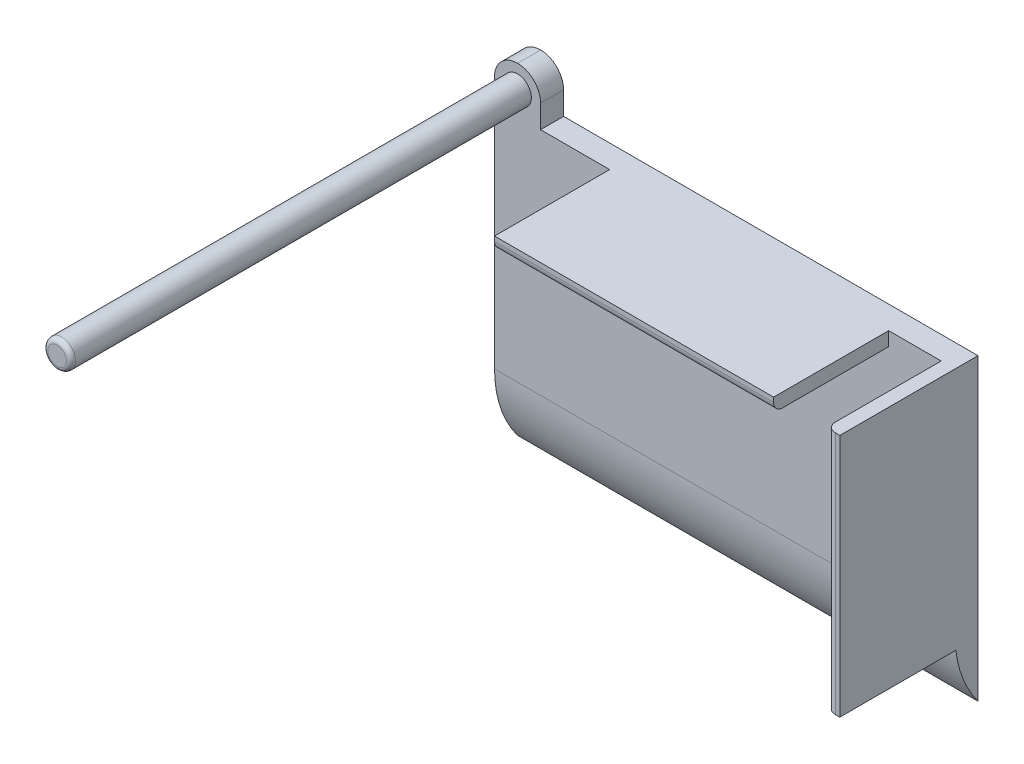
ISO-10303-21;
HEADER;
FILE_DESCRIPTION(('STEP AP214'),'2;1');
FILE_NAME('part.step','',(''),(''),'','','');
FILE_SCHEMA(('AUTOMOTIVE_DESIGN { 1 0 10303 214 1 1 1 1 }'));
ENDSEC;
DATA;
#1=APPLICATION_CONTEXT('core data for automotive mechanical design processes');
#2=APPLICATION_PROTOCOL_DEFINITION('international standard','automotive_design',2000,#1);
#3=PRODUCT_CONTEXT('',#1,'mechanical');
#4=PRODUCT('Part','Part','',(#3));
#5=PRODUCT_RELATED_PRODUCT_CATEGORY('part','',(#4));
#6=PRODUCT_DEFINITION_FORMATION('','',#4);
#7=PRODUCT_DEFINITION_CONTEXT('part definition',#1,'design');
#8=PRODUCT_DEFINITION('design','',#6,#7);
#9=PRODUCT_DEFINITION_SHAPE('','',#8);
#10=(LENGTH_UNIT() NAMED_UNIT(*) SI_UNIT(.MILLI.,.METRE.));
#11=(NAMED_UNIT(*) PLANE_ANGLE_UNIT() SI_UNIT($,.RADIAN.));
#12=(NAMED_UNIT(*) SI_UNIT($,.STERADIAN.) SOLID_ANGLE_UNIT());
#13=UNCERTAINTY_MEASURE_WITH_UNIT(LENGTH_MEASURE(1.E-05),#10,'distance_accuracy_value','');
#14=(GEOMETRIC_REPRESENTATION_CONTEXT(3) GLOBAL_UNCERTAINTY_ASSIGNED_CONTEXT((#13)) GLOBAL_UNIT_ASSIGNED_CONTEXT((#10,
#11,#12)) REPRESENTATION_CONTEXT('',''));
#15=CARTESIAN_POINT('',(0.,0.,0.));
#16=DIRECTION('',(0.,0.,1.));
#17=DIRECTION('',(1.,0.,0.));
#18=AXIS2_PLACEMENT_3D('',#15,#16,#17);
#19=CARTESIAN_POINT('',(0.,0.,30.));
#20=DIRECTION('',(0.,0.,-1.));
#21=DIRECTION('',(-1.,0.,0.));
#22=AXIS2_PLACEMENT_3D('',#19,#20,#21);
#23=PLANE('',#22);
#24=DIRECTION('',(1.,0.,0.));
#25=VECTOR('',#24,1.);
#26=CARTESIAN_POINT('',(-25.,32.5,30.));
#27=LINE('',#26,#25);
#28=CARTESIAN_POINT('',(49.,32.5,30.));
#29=VERTEX_POINT('',#28);
#30=CARTESIAN_POINT('',(50.,32.5,30.));
#31=VERTEX_POINT('',#30);
#32=EDGE_CURVE('E186',#29,#31,#27,.T.);
#33=ORIENTED_EDGE('',*,*,#32,.F.);
#34=DIRECTION('',(0.,1.,0.));
#35=VECTOR('',#34,1.);
#36=CARTESIAN_POINT('',(49.,-20.5,30.));
#37=LINE('',#36,#35);
#38=CARTESIAN_POINT('',(49.,-20.5,30.));
#39=VERTEX_POINT('',#38);
#40=EDGE_CURVE('E270',#29,#39,#37,.F.);
#41=ORIENTED_EDGE('',*,*,#40,.T.);
#42=DIRECTION('',(-1.,0.,0.));
#43=VECTOR('',#42,1.);
#44=CARTESIAN_POINT('',(50.,-20.5,30.));
#45=LINE('',#44,#43);
#46=CARTESIAN_POINT('',(50.,-20.5,30.));
#47=VERTEX_POINT('',#46);
#48=EDGE_CURVE('E327',#47,#39,#45,.T.);
#49=ORIENTED_EDGE('',*,*,#48,.F.);
#50=DIRECTION('',(0.,-1.,0.));
#51=VECTOR('',#50,1.);
#52=CARTESIAN_POINT('',(50.,32.5,30.));
#53=LINE('',#52,#51);
#54=EDGE_CURVE('E324',#31,#47,#53,.T.);
#55=ORIENTED_EDGE('',*,*,#54,.F.);
#56=EDGE_LOOP('',(#33,#41,#49,#55));
#57=FACE_BOUND('',#56,.T.);
#58=ADVANCED_FACE('F47',(#57),#23,.F.);
#59=CARTESIAN_POINT('',(-50.,32.5,5.));
#60=DIRECTION('',(0.,-1.,0.));
#61=DIRECTION('',(0.,0.,-1.));
#62=AXIS2_PLACEMENT_3D('',#59,#60,#61);
#63=PLANE('',#62);
#64=DIRECTION('',(0.,0.,1.));
#65=VECTOR('',#64,1.);
#66=CARTESIAN_POINT('',(47.,32.5,5.));
#67=LINE('',#66,#65);
#68=CARTESIAN_POINT('',(47.,32.5,5.));
#69=VERTEX_POINT('',#68);
#70=CARTESIAN_POINT('',(47.,32.5,28.));
#71=VERTEX_POINT('',#70);
#72=EDGE_CURVE('E316',#69,#71,#67,.T.);
#73=ORIENTED_EDGE('',*,*,#72,.T.);
#74=CARTESIAN_POINT('',(49.,32.5,28.));
#75=DIRECTION('',(0.,-1.,0.));
#76=DIRECTION('',(0.,0.,-1.));
#77=AXIS2_PLACEMENT_3D('',#74,#75,#76);
#78=CIRCLE('',#77,2.);
#79=EDGE_CURVE('E268',#71,#29,#78,.F.);
#80=ORIENTED_EDGE('',*,*,#79,.T.);
#81=ORIENTED_EDGE('',*,*,#32,.T.);
#82=DIRECTION('',(0.,0.,-1.));
#83=VECTOR('',#82,1.);
#84=CARTESIAN_POINT('',(50.,32.5,5.));
#85=LINE('',#84,#83);
#86=CARTESIAN_POINT('',(50.,32.5,0.));
#87=VERTEX_POINT('',#86);
#88=EDGE_CURVE('E214',#31,#87,#85,.T.);
#89=ORIENTED_EDGE('',*,*,#88,.T.);
#90=DIRECTION('',(-1.,0.,0.));
#91=VECTOR('',#90,1.);
#92=CARTESIAN_POINT('',(-50.,32.5,0.));
#93=LINE('',#92,#91);
#94=CARTESIAN_POINT('',(-40.,32.5,0.));
#95=VERTEX_POINT('',#94);
#96=EDGE_CURVE('E217',#87,#95,#93,.T.);
#97=ORIENTED_EDGE('',*,*,#96,.T.);
#98=DIRECTION('',(0.,0.,-1.));
#99=VECTOR('',#98,1.);
#100=CARTESIAN_POINT('',(-40.,32.5,5.));
#101=LINE('',#100,#99);
#102=CARTESIAN_POINT('',(-40.,32.5,5.));
#103=VERTEX_POINT('',#102);
#104=EDGE_CURVE('E194',#103,#95,#101,.T.);
#105=ORIENTED_EDGE('',*,*,#104,.F.);
#106=DIRECTION('',(-1.,0.,0.));
#107=VECTOR('',#106,1.);
#108=CARTESIAN_POINT('',(-50.,32.5,5.));
#109=LINE('',#108,#107);
#110=CARTESIAN_POINT('',(-25.,32.5,5.));
#111=VERTEX_POINT('',#110);
#112=EDGE_CURVE('E208',#111,#103,#109,.T.);
#113=ORIENTED_EDGE('',*,*,#112,.F.);
#114=DIRECTION('',(0.,0.,-1.));
#115=VECTOR('',#114,1.);
#116=CARTESIAN_POINT('',(-25.,32.5,30.));
#117=LINE('',#116,#115);
#118=CARTESIAN_POINT('',(-25.,32.5,30.));
#119=VERTEX_POINT('',#118);
#120=EDGE_CURVE('E192',#119,#111,#117,.T.);
#121=ORIENTED_EDGE('',*,*,#120,.F.);
#122=CARTESIAN_POINT('',(35.603755634213,32.5,30.));
#123=VERTEX_POINT('',#122);
#124=EDGE_CURVE('E322',#119,#123,#27,.T.);
#125=ORIENTED_EDGE('',*,*,#124,.T.);
#126=DIRECTION('',(0.,0.,-1.));
#127=VECTOR('',#126,1.);
#128=CARTESIAN_POINT('',(35.603755634213,32.5,5.));
#129=LINE('',#128,#127);
#130=CARTESIAN_POINT('',(35.603755634213,32.5,5.));
#131=VERTEX_POINT('',#130);
#132=EDGE_CURVE('E179',#123,#131,#129,.T.);
#133=ORIENTED_EDGE('',*,*,#132,.T.);
#134=DIRECTION('',(-1.,0.,0.));
#135=VECTOR('',#134,1.);
#136=CARTESIAN_POINT('',(-50.,32.5,5.));
#137=LINE('',#136,#135);
#138=EDGE_CURVE('E167',#69,#131,#137,.T.);
#139=ORIENTED_EDGE('',*,*,#138,.F.);
#140=EDGE_LOOP('',(#73,#80,#81,#89,#97,#105,#113,#121,#125,#133,#139));
#141=FACE_BOUND('',#140,.T.);
#142=ADVANCED_FACE('F284',(#141),#63,.F.);
#143=CARTESIAN_POINT('',(50.,-32.5,5.));
#144=DIRECTION('',(-1.,0.,0.));
#145=DIRECTION('',(0.,0.,1.));
#146=AXIS2_PLACEMENT_3D('',#143,#144,#145);
#147=PLANE('',#146);
#148=DIRECTION('',(0.,0.,-1.));
#149=VECTOR('',#148,1.);
#150=CARTESIAN_POINT('',(50.,-20.5,30.));
#151=LINE('',#150,#149);
#152=CARTESIAN_POINT('',(50.,-20.5,4.81934729198171));
#153=VERTEX_POINT('',#152);
#154=EDGE_CURVE('E198',#47,#153,#151,.T.);
#155=ORIENTED_EDGE('',*,*,#154,.T.);
#156=CARTESIAN_POINT('',(50.,-17.5,-20.));
#157=DIRECTION('',(-1.,0.,0.));
#158=DIRECTION('',(0.,0.,1.));
#159=AXIS2_PLACEMENT_3D('',#156,#157,#158);
#160=CIRCLE('',#159,25.);
#161=CARTESIAN_POINT('',(50.,-32.5,0.));
#162=VERTEX_POINT('',#161);
#163=EDGE_CURVE('E247',#153,#162,#160,.F.);
#164=ORIENTED_EDGE('',*,*,#163,.T.);
#165=DIRECTION('',(0.,1.,0.));
#166=VECTOR('',#165,1.);
#167=CARTESIAN_POINT('',(50.,-32.5,0.));
#168=LINE('',#167,#166);
#169=EDGE_CURVE('E207',#162,#87,#168,.T.);
#170=ORIENTED_EDGE('',*,*,#169,.T.);
#171=ORIENTED_EDGE('',*,*,#88,.F.);
#172=ORIENTED_EDGE('',*,*,#54,.T.);
#173=EDGE_LOOP('',(#155,#164,#170,#171,#172));
#174=FACE_BOUND('',#173,.T.);
#175=ADVANCED_FACE('F342',(#174),#147,.F.);
#176=CARTESIAN_POINT('',(-50.,-32.5,5.));
#177=DIRECTION('',(1.,0.,0.));
#178=DIRECTION('',(0.,0.,-1.));
#179=AXIS2_PLACEMENT_3D('',#176,#177,#178);
#180=PLANE('',#179);
#181=DIRECTION('',(0.,-1.,0.));
#182=VECTOR('',#181,1.);
#183=CARTESIAN_POINT('',(-50.,-32.5,0.));
#184=LINE('',#183,#182);
#185=CARTESIAN_POINT('',(-50.,37.5,0.));
#186=VERTEX_POINT('',#185);
#187=CARTESIAN_POINT('',(-50.,-32.5,0.));
#188=VERTEX_POINT('',#187);
#189=EDGE_CURVE('E220',#186,#188,#184,.T.);
#190=ORIENTED_EDGE('',*,*,#189,.T.);
#191=CARTESIAN_POINT('',(-50.,-17.5,-20.));
#192=DIRECTION('',(1.,0.,0.));
#193=DIRECTION('',(0.,0.,-1.));
#194=AXIS2_PLACEMENT_3D('',#191,#192,#193);
#195=CIRCLE('',#194,25.);
#196=CARTESIAN_POINT('',(-50.,-17.5,5.));
#197=VERTEX_POINT('',#196);
#198=EDGE_CURVE('E249',#188,#197,#195,.F.);
#199=ORIENTED_EDGE('',*,*,#198,.T.);
#200=DIRECTION('',(0.,-1.,0.));
#201=VECTOR('',#200,1.);
#202=CARTESIAN_POINT('',(-50.,-32.5,5.));
#203=LINE('',#202,#201);
#204=CARTESIAN_POINT('',(-50.,37.5,5.));
#205=VERTEX_POINT('',#204);
#206=EDGE_CURVE('E211',#205,#197,#203,.T.);
#207=ORIENTED_EDGE('',*,*,#206,.F.);
#208=DIRECTION('',(0.,0.,1.));
#209=VECTOR('',#208,1.);
#210=CARTESIAN_POINT('',(-50.,37.5,5.));
#211=LINE('',#210,#209);
#212=EDGE_CURVE('E233',#205,#186,#211,.F.);
#213=ORIENTED_EDGE('',*,*,#212,.T.);
#214=EDGE_LOOP('',(#190,#199,#207,#213));
#215=FACE_BOUND('',#214,.T.);
#216=ADVANCED_FACE('F303',(#215),#180,.F.);
#217=CARTESIAN_POINT('',(0.,0.,5.));
#218=DIRECTION('',(0.,0.,-1.));
#219=DIRECTION('',(-1.,0.,0.));
#220=AXIS2_PLACEMENT_3D('',#217,#218,#219);
#221=PLANE('',#220);
#222=CARTESIAN_POINT('',(-45.,37.5,5.));
#223=DIRECTION('',(0.,0.,-1.));
#224=DIRECTION('',(-1.,0.,0.));
#225=AXIS2_PLACEMENT_3D('',#222,#223,#224);
#226=CIRCLE('',#225,3.);
#227=CARTESIAN_POINT('',(-48.,37.5,5.));
#228=VERTEX_POINT('',#227);
#229=EDGE_CURVE('E226',#228,#228,#226,.F.);
#230=ORIENTED_EDGE('',*,*,#229,.F.);
#231=EDGE_LOOP('',(#230));
#232=FACE_BOUND('',#231,.T.);
#233=ORIENTED_EDGE('',*,*,#206,.T.);
#234=DIRECTION('',(-1.,0.,0.));
#235=VECTOR('',#234,1.);
#236=CARTESIAN_POINT('',(0.,-17.5,5.));
#237=LINE('',#236,#235);
#238=CARTESIAN_POINT('',(47.,-17.5,5.));
#239=VERTEX_POINT('',#238);
#240=EDGE_CURVE('E242',#197,#239,#237,.F.);
#241=ORIENTED_EDGE('',*,*,#240,.T.);
#242=DIRECTION('',(0.,1.,0.));
#243=VECTOR('',#242,1.);
#244=CARTESIAN_POINT('',(47.,-20.5,5.));
#245=LINE('',#244,#243);
#246=EDGE_CURVE('E184',#239,#69,#245,.T.);
#247=ORIENTED_EDGE('',*,*,#246,.T.);
#248=ORIENTED_EDGE('',*,*,#138,.T.);
#249=DIRECTION('',(0.,-1.,0.));
#250=VECTOR('',#249,1.);
#251=CARTESIAN_POINT('',(35.603755634213,29.5,5.));
#252=LINE('',#251,#250);
#253=CARTESIAN_POINT('',(35.603755634213,29.5,5.));
#254=VERTEX_POINT('',#253);
#255=EDGE_CURVE('E158',#131,#254,#252,.T.);
#256=ORIENTED_EDGE('',*,*,#255,.T.);
#257=DIRECTION('',(-1.,0.,0.));
#258=VECTOR('',#257,1.);
#259=CARTESIAN_POINT('',(47.,29.5,5.));
#260=LINE('',#259,#258);
#261=CARTESIAN_POINT('',(-25.,29.5,5.));
#262=VERTEX_POINT('',#261);
#263=EDGE_CURVE('E164',#254,#262,#260,.T.);
#264=ORIENTED_EDGE('',*,*,#263,.T.);
#265=DIRECTION('',(0.,1.,0.));
#266=VECTOR('',#265,1.);
#267=CARTESIAN_POINT('',(-25.,29.5,5.));
#268=LINE('',#267,#266);
#269=EDGE_CURVE('E183',#262,#111,#268,.T.);
#270=ORIENTED_EDGE('',*,*,#269,.T.);
#271=ORIENTED_EDGE('',*,*,#112,.T.);
#272=DIRECTION('',(0.,-1.,0.));
#273=VECTOR('',#272,1.);
#274=CARTESIAN_POINT('',(-40.,42.5,5.));
#275=LINE('',#274,#273);
#276=CARTESIAN_POINT('',(-40.,37.5,5.));
#277=VERTEX_POINT('',#276);
#278=EDGE_CURVE('E205',#277,#103,#275,.T.);
#279=ORIENTED_EDGE('',*,*,#278,.F.);
#280=CARTESIAN_POINT('',(-45.,37.5,5.));
#281=DIRECTION('',(0.,0.,-1.));
#282=DIRECTION('',(-1.,0.,0.));
#283=AXIS2_PLACEMENT_3D('',#280,#281,#282);
#284=CIRCLE('',#283,5.);
#285=CARTESIAN_POINT('',(-45.,42.5,5.));
#286=VERTEX_POINT('',#285);
#287=EDGE_CURVE('E229',#277,#286,#284,.F.);
#288=ORIENTED_EDGE('',*,*,#287,.T.);
#289=CARTESIAN_POINT('',(-45.,37.5,5.));
#290=DIRECTION('',(0.,0.,-1.));
#291=DIRECTION('',(-1.,0.,0.));
#292=AXIS2_PLACEMENT_3D('',#289,#290,#291);
#293=CIRCLE('',#292,5.);
#294=EDGE_CURVE('E231',#286,#205,#293,.F.);
#295=ORIENTED_EDGE('',*,*,#294,.T.);
#296=EDGE_LOOP('',(#233,#241,#247,#248,#256,#264,#270,#271,#279,#288,#295));
#297=FACE_BOUND('',#296,.T.);
#298=ADVANCED_FACE('F161',(#232,#297),#221,.F.);
#299=CARTESIAN_POINT('',(0.,0.,0.));
#300=DIRECTION('',(0.,0.,-1.));
#301=DIRECTION('',(-1.,0.,0.));
#302=AXIS2_PLACEMENT_3D('',#299,#300,#301);
#303=PLANE('',#302);
#304=ORIENTED_EDGE('',*,*,#189,.F.);
#305=CARTESIAN_POINT('',(-45.,37.5,0.));
#306=DIRECTION('',(0.,0.,-1.));
#307=DIRECTION('',(-1.,0.,0.));
#308=AXIS2_PLACEMENT_3D('',#305,#306,#307);
#309=CIRCLE('',#308,5.);
#310=CARTESIAN_POINT('',(-45.,42.5,0.));
#311=VERTEX_POINT('',#310);
#312=EDGE_CURVE('E238',#186,#311,#309,.T.);
#313=ORIENTED_EDGE('',*,*,#312,.T.);
#314=CARTESIAN_POINT('',(-45.,37.5,0.));
#315=DIRECTION('',(0.,0.,-1.));
#316=DIRECTION('',(-1.,0.,0.));
#317=AXIS2_PLACEMENT_3D('',#314,#315,#316);
#318=CIRCLE('',#317,5.);
#319=CARTESIAN_POINT('',(-40.,37.5,0.));
#320=VERTEX_POINT('',#319);
#321=EDGE_CURVE('E236',#311,#320,#318,.T.);
#322=ORIENTED_EDGE('',*,*,#321,.T.);
#323=DIRECTION('',(0.,-1.,0.));
#324=VECTOR('',#323,1.);
#325=CARTESIAN_POINT('',(-40.,42.5,0.));
#326=LINE('',#325,#324);
#327=EDGE_CURVE('E203',#320,#95,#326,.T.);
#328=ORIENTED_EDGE('',*,*,#327,.T.);
#329=ORIENTED_EDGE('',*,*,#96,.F.);
#330=ORIENTED_EDGE('',*,*,#169,.F.);
#331=DIRECTION('',(1.,0.,0.));
#332=VECTOR('',#331,1.);
#333=CARTESIAN_POINT('',(-50.,-32.5,0.));
#334=LINE('',#333,#332);
#335=EDGE_CURVE('E212',#188,#162,#334,.T.);
#336=ORIENTED_EDGE('',*,*,#335,.F.);
#337=EDGE_LOOP('',(#304,#313,#322,#328,#329,#330,#336));
#338=FACE_BOUND('',#337,.T.);
#339=ADVANCED_FACE('F366',(#338),#303,.T.);
#340=CARTESIAN_POINT('',(-40.,42.5,5.));
#341=DIRECTION('',(-1.,0.,0.));
#342=DIRECTION('',(0.,0.,1.));
#343=AXIS2_PLACEMENT_3D('',#340,#341,#342);
#344=PLANE('',#343);
#345=ORIENTED_EDGE('',*,*,#327,.F.);
#346=DIRECTION('',(0.,0.,-1.));
#347=VECTOR('',#346,1.);
#348=CARTESIAN_POINT('',(-40.,37.5,5.));
#349=LINE('',#348,#347);
#350=EDGE_CURVE('E240',#320,#277,#349,.F.);
#351=ORIENTED_EDGE('',*,*,#350,.T.);
#352=ORIENTED_EDGE('',*,*,#278,.T.);
#353=ORIENTED_EDGE('',*,*,#104,.T.);
#354=EDGE_LOOP('',(#345,#351,#352,#353));
#355=FACE_BOUND('',#354,.T.);
#356=ADVANCED_FACE('F289',(#355),#344,.F.);
#357=CARTESIAN_POINT('',(-25.,29.5,30.));
#358=DIRECTION('',(-1.,0.,0.));
#359=DIRECTION('',(0.,0.,1.));
#360=AXIS2_PLACEMENT_3D('',#357,#358,#359);
#361=PLANE('',#360);
#362=DIRECTION('',(0.,0.,-1.));
#363=VECTOR('',#362,1.);
#364=CARTESIAN_POINT('',(-25.,29.5,30.));
#365=LINE('',#364,#363);
#366=CARTESIAN_POINT('',(-25.,29.5,28.));
#367=VERTEX_POINT('',#366);
#368=EDGE_CURVE('E182',#367,#262,#365,.T.);
#369=ORIENTED_EDGE('',*,*,#368,.F.);
#370=CARTESIAN_POINT('',(-25.,31.5,28.));
#371=DIRECTION('',(-1.,0.,0.));
#372=DIRECTION('',(0.,0.,1.));
#373=AXIS2_PLACEMENT_3D('',#370,#371,#372);
#374=CIRCLE('',#373,2.);
#375=CARTESIAN_POINT('',(-25.,31.5,30.));
#376=VERTEX_POINT('',#375);
#377=EDGE_CURVE('E69',#367,#376,#374,.T.);
#378=ORIENTED_EDGE('',*,*,#377,.T.);
#379=DIRECTION('',(0.,1.,0.));
#380=VECTOR('',#379,1.);
#381=CARTESIAN_POINT('',(-25.,29.5,30.));
#382=LINE('',#381,#380);
#383=EDGE_CURVE('E200',#376,#119,#382,.T.);
#384=ORIENTED_EDGE('',*,*,#383,.T.);
#385=ORIENTED_EDGE('',*,*,#120,.T.);
#386=ORIENTED_EDGE('',*,*,#269,.F.);
#387=EDGE_LOOP('',(#369,#378,#384,#385,#386));
#388=FACE_BOUND('',#387,.T.);
#389=ADVANCED_FACE('F277',(#388),#361,.T.);
#390=CARTESIAN_POINT('',(47.,29.5,30.));
#391=DIRECTION('',(0.,-1.,0.));
#392=DIRECTION('',(0.,0.,-1.));
#393=AXIS2_PLACEMENT_3D('',#390,#391,#392);
#394=PLANE('',#393);
#395=DIRECTION('',(0.,0.,1.));
#396=VECTOR('',#395,1.);
#397=CARTESIAN_POINT('',(35.603755634213,29.5,5.));
#398=LINE('',#397,#396);
#399=CARTESIAN_POINT('',(35.603755634213,29.5,28.));
#400=VERTEX_POINT('',#399);
#401=EDGE_CURVE('E171',#254,#400,#398,.T.);
#402=ORIENTED_EDGE('',*,*,#401,.T.);
#403=DIRECTION('',(-1.,0.,0.));
#404=VECTOR('',#403,1.);
#405=CARTESIAN_POINT('',(-25.,29.5,28.));
#406=LINE('',#405,#404);
#407=EDGE_CURVE('E274',#400,#367,#406,.T.);
#408=ORIENTED_EDGE('',*,*,#407,.T.);
#409=ORIENTED_EDGE('',*,*,#368,.T.);
#410=ORIENTED_EDGE('',*,*,#263,.F.);
#411=EDGE_LOOP('',(#402,#408,#409,#410));
#412=FACE_BOUND('',#411,.T.);
#413=ADVANCED_FACE('F181',(#412),#394,.T.);
#414=CARTESIAN_POINT('',(47.,-20.5,30.));
#415=DIRECTION('',(-1.,0.,0.));
#416=DIRECTION('',(0.,-1.,0.));
#417=AXIS2_PLACEMENT_3D('',#414,#415,#416);
#418=PLANE('',#417);
#419=DIRECTION('',(0.,0.,-1.));
#420=VECTOR('',#419,1.);
#421=CARTESIAN_POINT('',(47.,-20.5,30.));
#422=LINE('',#421,#420);
#423=CARTESIAN_POINT('',(47.,-20.5,28.));
#424=VERTEX_POINT('',#423);
#425=CARTESIAN_POINT('',(47.,-20.5,4.81934729198171));
#426=VERTEX_POINT('',#425);
#427=EDGE_CURVE('E196',#424,#426,#422,.T.);
#428=ORIENTED_EDGE('',*,*,#427,.F.);
#429=DIRECTION('',(0.,1.,0.));
#430=VECTOR('',#429,1.);
#431=CARTESIAN_POINT('',(47.,32.5,28.));
#432=LINE('',#431,#430);
#433=EDGE_CURVE('E265',#424,#71,#432,.T.);
#434=ORIENTED_EDGE('',*,*,#433,.T.);
#435=ORIENTED_EDGE('',*,*,#72,.F.);
#436=ORIENTED_EDGE('',*,*,#246,.F.);
#437=CARTESIAN_POINT('',(47.,-17.5,-20.));
#438=DIRECTION('',(-1.,0.,0.));
#439=DIRECTION('',(0.,-1.,0.));
#440=AXIS2_PLACEMENT_3D('',#437,#438,#439);
#441=CIRCLE('',#440,25.);
#442=EDGE_CURVE('E251',#239,#426,#441,.F.);
#443=ORIENTED_EDGE('',*,*,#442,.T.);
#444=EDGE_LOOP('',(#428,#434,#435,#436,#443));
#445=FACE_BOUND('',#444,.T.);
#446=ADVANCED_FACE('F315',(#445),#418,.T.);
#447=CARTESIAN_POINT('',(50.,-20.5,30.));
#448=DIRECTION('',(0.,-1.,0.));
#449=DIRECTION('',(1.,0.,0.));
#450=AXIS2_PLACEMENT_3D('',#447,#448,#449);
#451=PLANE('',#450);
#452=ORIENTED_EDGE('',*,*,#48,.T.);
#453=CARTESIAN_POINT('',(49.,-20.5,28.));
#454=DIRECTION('',(0.,-1.,0.));
#455=DIRECTION('',(1.,0.,0.));
#456=AXIS2_PLACEMENT_3D('',#453,#454,#455);
#457=CIRCLE('',#456,2.);
#458=EDGE_CURVE('E272',#39,#424,#457,.T.);
#459=ORIENTED_EDGE('',*,*,#458,.T.);
#460=ORIENTED_EDGE('',*,*,#427,.T.);
#461=DIRECTION('',(-1.,0.,0.));
#462=VECTOR('',#461,1.);
#463=CARTESIAN_POINT('',(47.,-20.5,4.81934729198171));
#464=LINE('',#463,#462);
#465=EDGE_CURVE('E254',#426,#153,#464,.F.);
#466=ORIENTED_EDGE('',*,*,#465,.T.);
#467=ORIENTED_EDGE('',*,*,#154,.F.);
#468=EDGE_LOOP('',(#452,#459,#460,#466,#467));
#469=FACE_BOUND('',#468,.T.);
#470=ADVANCED_FACE('F349',(#469),#451,.T.);
#471=ORIENTED_EDGE('',*,*,#383,.F.);
#472=DIRECTION('',(-1.,0.,0.));
#473=VECTOR('',#472,1.);
#474=CARTESIAN_POINT('',(35.603755634213,31.5,30.));
#475=LINE('',#474,#473);
#476=CARTESIAN_POINT('',(35.603755634213,31.5,30.));
#477=VERTEX_POINT('',#476);
#478=EDGE_CURVE('E55',#376,#477,#475,.F.);
#479=ORIENTED_EDGE('',*,*,#478,.T.);
#480=DIRECTION('',(0.,1.,0.));
#481=VECTOR('',#480,1.);
#482=CARTESIAN_POINT('',(35.603755634213,0.,30.));
#483=LINE('',#482,#481);
#484=EDGE_CURVE('E263',#477,#123,#483,.T.);
#485=ORIENTED_EDGE('',*,*,#484,.T.);
#486=ORIENTED_EDGE('',*,*,#124,.F.);
#487=EDGE_LOOP('',(#471,#479,#485,#486));
#488=FACE_BOUND('',#487,.T.);
#489=ADVANCED_FACE('F329',(#488),#23,.F.);
#490=CARTESIAN_POINT('',(-45.,37.5,105.));
#491=DIRECTION('',(0.,0.,-1.));
#492=DIRECTION('',(-1.,0.,0.));
#493=AXIS2_PLACEMENT_3D('',#490,#491,#492);
#494=CYLINDRICAL_SURFACE('',#493,3.);
#495=CARTESIAN_POINT('',(-45.,37.5,104.));
#496=DIRECTION('',(0.,0.,1.));
#497=DIRECTION('',(1.,0.,0.));
#498=AXIS2_PLACEMENT_3D('',#495,#496,#497);
#499=CIRCLE('',#498,3.);
#500=CARTESIAN_POINT('',(-42.,37.5,104.));
#501=VERTEX_POINT('',#500);
#502=EDGE_CURVE('E260',#501,#501,#499,.F.);
#503=ORIENTED_EDGE('',*,*,#502,.T.);
#504=EDGE_LOOP('',(#503));
#505=FACE_BOUND('',#504,.T.);
#506=ORIENTED_EDGE('',*,*,#229,.T.);
#507=EDGE_LOOP('',(#506));
#508=FACE_BOUND('',#507,.T.);
#509=ADVANCED_FACE('F348',(#505,#508),#494,.T.);
#510=CARTESIAN_POINT('',(0.,0.,105.));
#511=DIRECTION('',(0.,0.,1.));
#512=DIRECTION('',(1.,0.,0.));
#513=AXIS2_PLACEMENT_3D('',#510,#511,#512);
#514=PLANE('',#513);
#515=CARTESIAN_POINT('',(-45.,37.5,105.));
#516=DIRECTION('',(0.,0.,1.));
#517=DIRECTION('',(1.,0.,0.));
#518=AXIS2_PLACEMENT_3D('',#515,#516,#517);
#519=CIRCLE('',#518,2.);
#520=CARTESIAN_POINT('',(-43.,37.5,105.));
#521=VERTEX_POINT('',#520);
#522=EDGE_CURVE('E257',#521,#521,#519,.T.);
#523=ORIENTED_EDGE('',*,*,#522,.T.);
#524=EDGE_LOOP('',(#523));
#525=FACE_BOUND('',#524,.T.);
#526=ADVANCED_FACE('F354',(#525),#514,.T.);
#527=CARTESIAN_POINT('',(-45.,37.5,0.));
#528=DIRECTION('',(0.,0.,-1.));
#529=DIRECTION('',(-1.,0.,0.));
#530=AXIS2_PLACEMENT_3D('',#527,#528,#529);
#531=CYLINDRICAL_SURFACE('',#530,5.);
#532=ORIENTED_EDGE('',*,*,#350,.F.);
#533=ORIENTED_EDGE('',*,*,#321,.F.);
#534=DIRECTION('',(0.,0.,-1.));
#535=VECTOR('',#534,1.);
#536=CARTESIAN_POINT('',(-45.,42.5,0.));
#537=LINE('',#536,#535);
#538=EDGE_CURVE('E188',#286,#311,#537,.T.);
#539=ORIENTED_EDGE('',*,*,#538,.F.);
#540=ORIENTED_EDGE('',*,*,#287,.F.);
#541=EDGE_LOOP('',(#532,#533,#539,#540));
#542=FACE_BOUND('',#541,.T.);
#543=ADVANCED_FACE('F294',(#542),#531,.T.);
#544=CARTESIAN_POINT('',(-45.,37.5,0.));
#545=DIRECTION('',(0.,0.,1.));
#546=DIRECTION('',(1.,0.,0.));
#547=AXIS2_PLACEMENT_3D('',#544,#545,#546);
#548=CYLINDRICAL_SURFACE('',#547,5.);
#549=ORIENTED_EDGE('',*,*,#312,.F.);
#550=ORIENTED_EDGE('',*,*,#212,.F.);
#551=ORIENTED_EDGE('',*,*,#294,.F.);
#552=ORIENTED_EDGE('',*,*,#538,.T.);
#553=EDGE_LOOP('',(#549,#550,#551,#552));
#554=FACE_BOUND('',#553,.T.);
#555=ADVANCED_FACE('F299',(#554),#548,.T.);
#556=CARTESIAN_POINT('',(-50.,-17.5,-20.));
#557=DIRECTION('',(-1.,0.,0.));
#558=DIRECTION('',(0.,0.,1.));
#559=AXIS2_PLACEMENT_3D('',#556,#557,#558);
#560=CYLINDRICAL_SURFACE('',#559,25.);
#561=ORIENTED_EDGE('',*,*,#198,.F.);
#562=ORIENTED_EDGE('',*,*,#335,.T.);
#563=ORIENTED_EDGE('',*,*,#163,.F.);
#564=ORIENTED_EDGE('',*,*,#465,.F.);
#565=ORIENTED_EDGE('',*,*,#442,.F.);
#566=ORIENTED_EDGE('',*,*,#240,.F.);
#567=EDGE_LOOP('',(#561,#562,#563,#564,#565,#566));
#568=FACE_BOUND('',#567,.T.);
#569=ADVANCED_FACE('F308',(#568),#560,.T.);
#570=CARTESIAN_POINT('',(-45.,37.5,104.));
#571=DIRECTION('',(0.,0.,1.));
#572=DIRECTION('',(1.,0.,0.));
#573=AXIS2_PLACEMENT_3D('',#570,#571,#572);
#574=TOROIDAL_SURFACE('',#573,2.,1.);
#575=ORIENTED_EDGE('',*,*,#502,.F.);
#576=EDGE_LOOP('',(#575));
#577=FACE_BOUND('',#576,.T.);
#578=ORIENTED_EDGE('',*,*,#522,.F.);
#579=EDGE_LOOP('',(#578));
#580=FACE_BOUND('',#579,.T.);
#581=ADVANCED_FACE('F384',(#577,#580),#574,.T.);
#582=CARTESIAN_POINT('',(35.603755634213,29.5,5.));
#583=DIRECTION('',(-1.,0.,0.));
#584=DIRECTION('',(0.,0.,1.));
#585=AXIS2_PLACEMENT_3D('',#582,#583,#584);
#586=PLANE('',#585);
#587=ORIENTED_EDGE('',*,*,#484,.F.);
#588=CARTESIAN_POINT('',(35.603755634213,31.5,28.));
#589=DIRECTION('',(-1.,0.,0.));
#590=DIRECTION('',(0.,0.,1.));
#591=AXIS2_PLACEMENT_3D('',#588,#589,#590);
#592=CIRCLE('',#591,2.);
#593=EDGE_CURVE('E12',#477,#400,#592,.F.);
#594=ORIENTED_EDGE('',*,*,#593,.T.);
#595=ORIENTED_EDGE('',*,*,#401,.F.);
#596=ORIENTED_EDGE('',*,*,#255,.F.);
#597=ORIENTED_EDGE('',*,*,#132,.F.);
#598=EDGE_LOOP('',(#587,#594,#595,#596,#597));
#599=FACE_BOUND('',#598,.T.);
#600=ADVANCED_FACE('F174',(#599),#586,.F.);
#601=CARTESIAN_POINT('',(49.,-20.5,28.));
#602=DIRECTION('',(0.,-1.,0.));
#603=DIRECTION('',(1.,0.,0.));
#604=AXIS2_PLACEMENT_3D('',#601,#602,#603);
#605=CYLINDRICAL_SURFACE('',#604,2.);
#606=ORIENTED_EDGE('',*,*,#458,.F.);
#607=ORIENTED_EDGE('',*,*,#40,.F.);
#608=ORIENTED_EDGE('',*,*,#79,.F.);
#609=ORIENTED_EDGE('',*,*,#433,.F.);
#610=EDGE_LOOP('',(#606,#607,#608,#609));
#611=FACE_BOUND('',#610,.T.);
#612=ADVANCED_FACE('F331',(#611),#605,.T.);
#613=CARTESIAN_POINT('',(47.,31.5,28.));
#614=DIRECTION('',(1.,0.,0.));
#615=DIRECTION('',(0.,0.,-1.));
#616=AXIS2_PLACEMENT_3D('',#613,#614,#615);
#617=CYLINDRICAL_SURFACE('',#616,2.);
#618=ORIENTED_EDGE('',*,*,#593,.F.);
#619=ORIENTED_EDGE('',*,*,#478,.F.);
#620=ORIENTED_EDGE('',*,*,#377,.F.);
#621=ORIENTED_EDGE('',*,*,#407,.F.);
#622=EDGE_LOOP('',(#618,#619,#620,#621));
#623=FACE_BOUND('',#622,.T.);
#624=ADVANCED_FACE('F49',(#623),#617,.T.);
#625=CLOSED_SHELL('',(#58,#142,#175,#216,#298,#339,#356,#389,#413,#446,#470,#489,#509,#526,#543,
#555,#569,#581,#600,#612,#624));
#626=MANIFOLD_SOLID_BREP('B2',#625);
#627=ADVANCED_BREP_SHAPE_REPRESENTATION('',(#18,#626),#14);
#628=SHAPE_DEFINITION_REPRESENTATION(#9,#627);
ENDSEC;
END-ISO-10303-21;
